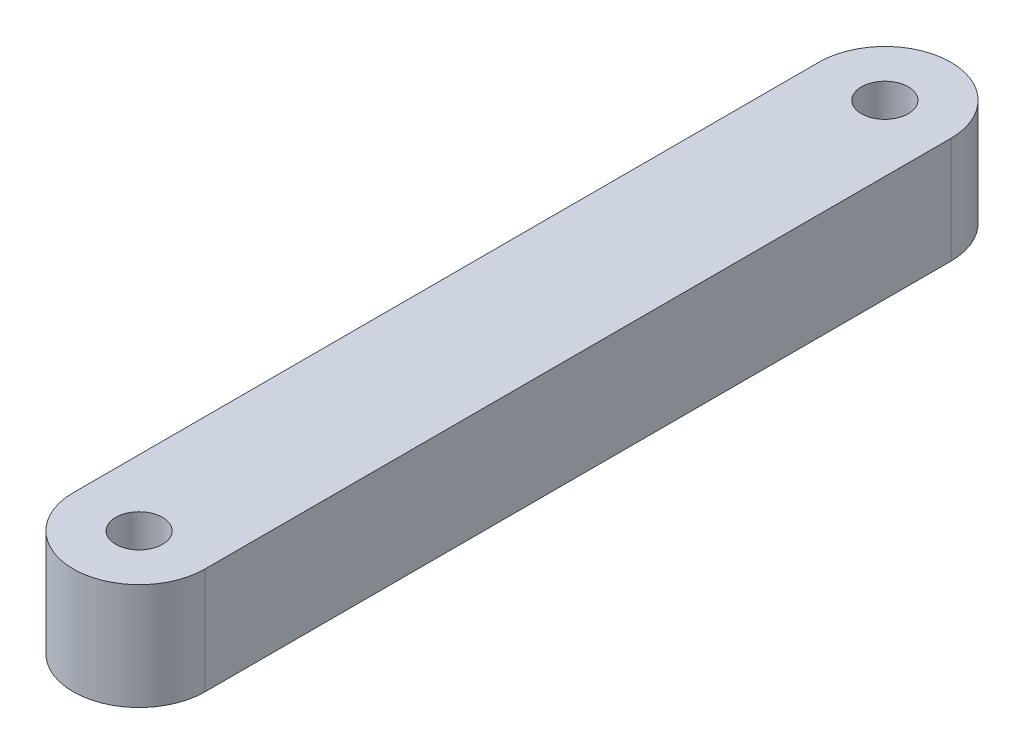
ISO-10303-21;
HEADER;
FILE_DESCRIPTION(('STEP AP214'),'2;1');
FILE_NAME('part.step','',(''),(''),'','','');
FILE_SCHEMA(('AUTOMOTIVE_DESIGN { 1 0 10303 214 1 1 1 1 }'));
ENDSEC;
DATA;
#1=APPLICATION_CONTEXT('core data for automotive mechanical design processes');
#2=APPLICATION_PROTOCOL_DEFINITION('international standard','automotive_design',2000,#1);
#3=PRODUCT_CONTEXT('',#1,'mechanical');
#4=PRODUCT('Part','Part','',(#3));
#5=PRODUCT_RELATED_PRODUCT_CATEGORY('part','',(#4));
#6=PRODUCT_DEFINITION_FORMATION('','',#4);
#7=PRODUCT_DEFINITION_CONTEXT('part definition',#1,'design');
#8=PRODUCT_DEFINITION('design','',#6,#7);
#9=PRODUCT_DEFINITION_SHAPE('','',#8);
#10=(LENGTH_UNIT() NAMED_UNIT(*) SI_UNIT(.MILLI.,.METRE.));
#11=(NAMED_UNIT(*) PLANE_ANGLE_UNIT() SI_UNIT($,.RADIAN.));
#12=(NAMED_UNIT(*) SI_UNIT($,.STERADIAN.) SOLID_ANGLE_UNIT());
#13=UNCERTAINTY_MEASURE_WITH_UNIT(LENGTH_MEASURE(1.E-05),#10,'distance_accuracy_value','');
#14=(GEOMETRIC_REPRESENTATION_CONTEXT(3) GLOBAL_UNCERTAINTY_ASSIGNED_CONTEXT((#13)) GLOBAL_UNIT_ASSIGNED_CONTEXT((#10,
#11,#12)) REPRESENTATION_CONTEXT('',''));
#15=CARTESIAN_POINT('',(0.,0.,0.));
#16=DIRECTION('',(0.,0.,1.));
#17=DIRECTION('',(1.,0.,0.));
#18=AXIS2_PLACEMENT_3D('',#15,#16,#17);
#19=CARTESIAN_POINT('',(3.1,5.,0.));
#20=DIRECTION('',(-1.,0.,0.));
#21=DIRECTION('',(0.,0.,1.));
#22=AXIS2_PLACEMENT_3D('',#19,#20,#21);
#23=PLANE('',#22);
#24=DIRECTION('',(0.,0.,-1.));
#25=VECTOR('',#24,1.);
#26=CARTESIAN_POINT('',(3.1,0.,0.));
#27=LINE('',#26,#25);
#28=CARTESIAN_POINT('',(3.10000000000001,0.,17.52));
#29=VERTEX_POINT('',#28);
#30=CARTESIAN_POINT('',(3.1,0.,-17.52));
#31=VERTEX_POINT('',#30);
#32=EDGE_CURVE('E106',#29,#31,#27,.T.);
#33=ORIENTED_EDGE('',*,*,#32,.T.);
#34=DIRECTION('',(0.,-1.,0.));
#35=VECTOR('',#34,1.);
#36=CARTESIAN_POINT('',(3.1,5.,-17.52));
#37=LINE('',#36,#35);
#38=CARTESIAN_POINT('',(3.1,5.,-17.52));
#39=VERTEX_POINT('',#38);
#40=EDGE_CURVE('E11',#39,#31,#37,.T.);
#41=ORIENTED_EDGE('',*,*,#40,.F.);
#42=DIRECTION('',(0.,0.,-1.));
#43=VECTOR('',#42,1.);
#44=CARTESIAN_POINT('',(3.1,5.,0.));
#45=LINE('',#44,#43);
#46=CARTESIAN_POINT('',(3.10000000000001,5.,17.52));
#47=VERTEX_POINT('',#46);
#48=EDGE_CURVE('E85',#47,#39,#45,.T.);
#49=ORIENTED_EDGE('',*,*,#48,.F.);
#50=DIRECTION('',(0.,-1.,0.));
#51=VECTOR('',#50,1.);
#52=CARTESIAN_POINT('',(3.10000000000001,5.,17.52));
#53=LINE('',#52,#51);
#54=EDGE_CURVE('E96',#47,#29,#53,.T.);
#55=ORIENTED_EDGE('',*,*,#54,.T.);
#56=EDGE_LOOP('',(#33,#41,#49,#55));
#57=FACE_BOUND('',#56,.T.);
#58=ADVANCED_FACE('F37',(#57),#23,.F.);
#59=CARTESIAN_POINT('',(0.,5.,-17.52));
#60=DIRECTION('',(0.,-1.,0.));
#61=DIRECTION('',(0.,0.,-1.));
#62=AXIS2_PLACEMENT_3D('',#59,#60,#61);
#63=CYLINDRICAL_SURFACE('',#62,3.10000000000001);
#64=CARTESIAN_POINT('',(0.,0.,-17.52));
#65=DIRECTION('',(0.,1.,0.));
#66=DIRECTION('',(0.,0.,1.));
#67=AXIS2_PLACEMENT_3D('',#64,#65,#66);
#68=CIRCLE('',#67,3.10000000000001);
#69=CARTESIAN_POINT('',(-3.10000000000001,0.,-17.52));
#70=VERTEX_POINT('',#69);
#71=EDGE_CURVE('E90',#31,#70,#68,.T.);
#72=ORIENTED_EDGE('',*,*,#71,.T.);
#73=DIRECTION('',(0.,-1.,0.));
#74=VECTOR('',#73,1.);
#75=CARTESIAN_POINT('',(-3.10000000000001,5.,-17.52));
#76=LINE('',#75,#74);
#77=CARTESIAN_POINT('',(-3.10000000000001,5.,-17.52));
#78=VERTEX_POINT('',#77);
#79=EDGE_CURVE('E46',#78,#70,#76,.T.);
#80=ORIENTED_EDGE('',*,*,#79,.F.);
#81=CARTESIAN_POINT('',(0.,5.,-17.52));
#82=DIRECTION('',(0.,1.,0.));
#83=DIRECTION('',(0.,0.,1.));
#84=AXIS2_PLACEMENT_3D('',#81,#82,#83);
#85=CIRCLE('',#84,3.10000000000001);
#86=EDGE_CURVE('E80',#39,#78,#85,.T.);
#87=ORIENTED_EDGE('',*,*,#86,.F.);
#88=ORIENTED_EDGE('',*,*,#40,.T.);
#89=EDGE_LOOP('',(#72,#80,#87,#88));
#90=FACE_BOUND('',#89,.T.);
#91=ADVANCED_FACE('F89',(#90),#63,.T.);
#92=CARTESIAN_POINT('',(-3.10000000000001,5.,0.));
#93=DIRECTION('',(-1.,0.,0.));
#94=DIRECTION('',(0.,0.,1.));
#95=AXIS2_PLACEMENT_3D('',#92,#93,#94);
#96=PLANE('',#95);
#97=DIRECTION('',(0.,0.,-1.));
#98=VECTOR('',#97,1.);
#99=CARTESIAN_POINT('',(-3.10000000000001,0.,0.));
#100=LINE('',#99,#98);
#101=CARTESIAN_POINT('',(-3.10000000000001,0.,17.52));
#102=VERTEX_POINT('',#101);
#103=EDGE_CURVE('E110',#102,#70,#100,.T.);
#104=ORIENTED_EDGE('',*,*,#103,.F.);
#105=DIRECTION('',(0.,-1.,0.));
#106=VECTOR('',#105,1.);
#107=CARTESIAN_POINT('',(-3.10000000000001,5.,17.52));
#108=LINE('',#107,#106);
#109=CARTESIAN_POINT('',(-3.10000000000001,5.,17.52));
#110=VERTEX_POINT('',#109);
#111=EDGE_CURVE('E70',#110,#102,#108,.T.);
#112=ORIENTED_EDGE('',*,*,#111,.F.);
#113=DIRECTION('',(0.,0.,-1.));
#114=VECTOR('',#113,1.);
#115=CARTESIAN_POINT('',(-3.10000000000001,5.,0.));
#116=LINE('',#115,#114);
#117=EDGE_CURVE('E83',#110,#78,#116,.T.);
#118=ORIENTED_EDGE('',*,*,#117,.T.);
#119=ORIENTED_EDGE('',*,*,#79,.T.);
#120=EDGE_LOOP('',(#104,#112,#118,#119));
#121=FACE_BOUND('',#120,.T.);
#122=ADVANCED_FACE('F94',(#121),#96,.T.);
#123=CARTESIAN_POINT('',(0.,5.,17.52));
#124=DIRECTION('',(0.,-1.,0.));
#125=DIRECTION('',(0.,0.,-1.));
#126=AXIS2_PLACEMENT_3D('',#123,#124,#125);
#127=CYLINDRICAL_SURFACE('',#126,1.1);
#128=CARTESIAN_POINT('',(0.,5.,17.52));
#129=DIRECTION('',(0.,1.,0.));
#130=DIRECTION('',(0.,0.,1.));
#131=AXIS2_PLACEMENT_3D('',#128,#129,#130);
#132=CIRCLE('',#131,1.1);
#133=CARTESIAN_POINT('',(0.,5.,18.62));
#134=VERTEX_POINT('',#133);
#135=EDGE_CURVE('E148',#134,#134,#132,.T.);
#136=ORIENTED_EDGE('',*,*,#135,.T.);
#137=EDGE_LOOP('',(#136));
#138=FACE_BOUND('',#137,.T.);
#139=CARTESIAN_POINT('',(0.,0.,17.52));
#140=DIRECTION('',(0.,1.,0.));
#141=DIRECTION('',(0.,0.,1.));
#142=AXIS2_PLACEMENT_3D('',#139,#140,#141);
#143=CIRCLE('',#142,1.1);
#144=CARTESIAN_POINT('',(0.,0.,18.62));
#145=VERTEX_POINT('',#144);
#146=EDGE_CURVE('E103',#145,#145,#143,.T.);
#147=ORIENTED_EDGE('',*,*,#146,.F.);
#148=EDGE_LOOP('',(#147));
#149=FACE_BOUND('',#148,.T.);
#150=ADVANCED_FACE('F137',(#138,#149),#127,.F.);
#151=CARTESIAN_POINT('',(0.,5.,-17.52));
#152=DIRECTION('',(0.,-1.,0.));
#153=DIRECTION('',(0.,0.,-1.));
#154=AXIS2_PLACEMENT_3D('',#151,#152,#153);
#155=CYLINDRICAL_SURFACE('',#154,1.1);
#156=CARTESIAN_POINT('',(0.,5.,-17.52));
#157=DIRECTION('',(0.,1.,0.));
#158=DIRECTION('',(0.,0.,1.));
#159=AXIS2_PLACEMENT_3D('',#156,#157,#158);
#160=CIRCLE('',#159,1.1);
#161=CARTESIAN_POINT('',(0.,5.,-16.42));
#162=VERTEX_POINT('',#161);
#163=EDGE_CURVE('E113',#162,#162,#160,.T.);
#164=ORIENTED_EDGE('',*,*,#163,.T.);
#165=EDGE_LOOP('',(#164));
#166=FACE_BOUND('',#165,.T.);
#167=CARTESIAN_POINT('',(0.,0.,-17.52));
#168=DIRECTION('',(0.,1.,0.));
#169=DIRECTION('',(0.,0.,1.));
#170=AXIS2_PLACEMENT_3D('',#167,#168,#169);
#171=CIRCLE('',#170,1.1);
#172=CARTESIAN_POINT('',(0.,0.,-16.42));
#173=VERTEX_POINT('',#172);
#174=EDGE_CURVE('E100',#173,#173,#171,.T.);
#175=ORIENTED_EDGE('',*,*,#174,.F.);
#176=EDGE_LOOP('',(#175));
#177=FACE_BOUND('',#176,.T.);
#178=ADVANCED_FACE('F39',(#166,#177),#155,.F.);
#179=CARTESIAN_POINT('',(0.,5.,17.52));
#180=DIRECTION('',(0.,-1.,0.));
#181=DIRECTION('',(0.,0.,-1.));
#182=AXIS2_PLACEMENT_3D('',#179,#180,#181);
#183=CYLINDRICAL_SURFACE('',#182,3.10000000000001);
#184=CARTESIAN_POINT('',(0.,0.,17.52));
#185=DIRECTION('',(0.,1.,0.));
#186=DIRECTION('',(0.,0.,1.));
#187=AXIS2_PLACEMENT_3D('',#184,#185,#186);
#188=CIRCLE('',#187,3.10000000000001);
#189=EDGE_CURVE('E73',#102,#29,#188,.T.);
#190=ORIENTED_EDGE('',*,*,#189,.T.);
#191=ORIENTED_EDGE('',*,*,#54,.F.);
#192=CARTESIAN_POINT('',(0.,5.,17.52));
#193=DIRECTION('',(0.,1.,0.));
#194=DIRECTION('',(0.,0.,1.));
#195=AXIS2_PLACEMENT_3D('',#192,#193,#194);
#196=CIRCLE('',#195,3.10000000000001);
#197=EDGE_CURVE('E54',#110,#47,#196,.T.);
#198=ORIENTED_EDGE('',*,*,#197,.F.);
#199=ORIENTED_EDGE('',*,*,#111,.T.);
#200=EDGE_LOOP('',(#190,#191,#198,#199));
#201=FACE_BOUND('',#200,.T.);
#202=ADVANCED_FACE('F125',(#201),#183,.T.);
#203=CARTESIAN_POINT('',(0.,5.,0.));
#204=DIRECTION('',(0.,1.,0.));
#205=DIRECTION('',(0.,0.,1.));
#206=AXIS2_PLACEMENT_3D('',#203,#204,#205);
#207=PLANE('',#206);
#208=ORIENTED_EDGE('',*,*,#163,.F.);
#209=EDGE_LOOP('',(#208));
#210=FACE_BOUND('',#209,.T.);
#211=ORIENTED_EDGE('',*,*,#135,.F.);
#212=EDGE_LOOP('',(#211));
#213=FACE_BOUND('',#212,.T.);
#214=ORIENTED_EDGE('',*,*,#48,.T.);
#215=ORIENTED_EDGE('',*,*,#86,.T.);
#216=ORIENTED_EDGE('',*,*,#117,.F.);
#217=ORIENTED_EDGE('',*,*,#197,.T.);
#218=EDGE_LOOP('',(#214,#215,#216,#217));
#219=FACE_BOUND('',#218,.T.);
#220=ADVANCED_FACE('F81',(#210,#213,#219),#207,.T.);
#221=CARTESIAN_POINT('',(0.,0.,0.));
#222=DIRECTION('',(0.,1.,0.));
#223=DIRECTION('',(0.,0.,1.));
#224=AXIS2_PLACEMENT_3D('',#221,#222,#223);
#225=PLANE('',#224);
#226=ORIENTED_EDGE('',*,*,#174,.T.);
#227=EDGE_LOOP('',(#226));
#228=FACE_BOUND('',#227,.T.);
#229=ORIENTED_EDGE('',*,*,#146,.T.);
#230=EDGE_LOOP('',(#229));
#231=FACE_BOUND('',#230,.T.);
#232=ORIENTED_EDGE('',*,*,#32,.F.);
#233=ORIENTED_EDGE('',*,*,#189,.F.);
#234=ORIENTED_EDGE('',*,*,#103,.T.);
#235=ORIENTED_EDGE('',*,*,#71,.F.);
#236=EDGE_LOOP('',(#232,#233,#234,#235));
#237=FACE_BOUND('',#236,.T.);
#238=ADVANCED_FACE('F118',(#228,#231,#237),#225,.F.);
#239=CLOSED_SHELL('',(#58,#91,#122,#150,#178,#202,#220,#238));
#240=MANIFOLD_SOLID_BREP('B2',#239);
#241=ADVANCED_BREP_SHAPE_REPRESENTATION('',(#18,#240),#14);
#242=SHAPE_DEFINITION_REPRESENTATION(#9,#241);
ENDSEC;
END-ISO-10303-21;
